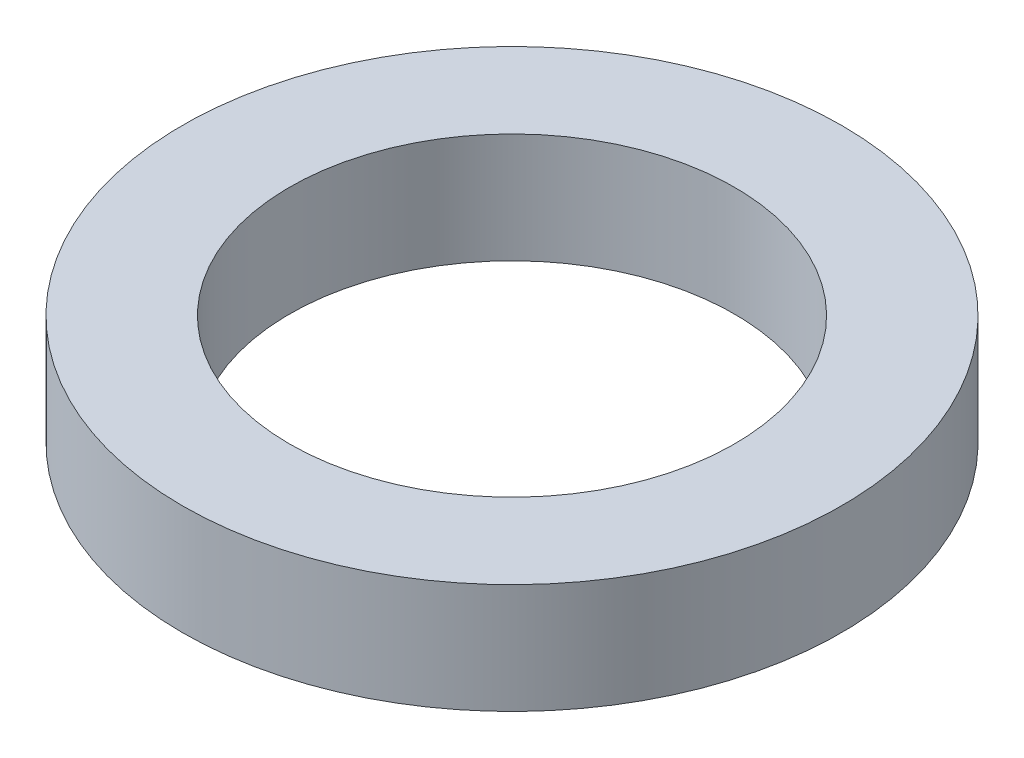
ISO-10303-21;
HEADER;
FILE_DESCRIPTION(('STEP AP214'),'2;1');
FILE_NAME('part.step','',(''),(''),'','','');
FILE_SCHEMA(('AUTOMOTIVE_DESIGN { 1 0 10303 214 1 1 1 1 }'));
ENDSEC;
DATA;
#1=APPLICATION_CONTEXT('core data for automotive mechanical design processes');
#2=APPLICATION_PROTOCOL_DEFINITION('international standard','automotive_design',2000,#1);
#3=PRODUCT_CONTEXT('',#1,'mechanical');
#4=PRODUCT('Part','Part','',(#3));
#5=PRODUCT_RELATED_PRODUCT_CATEGORY('part','',(#4));
#6=PRODUCT_DEFINITION_FORMATION('','',#4);
#7=PRODUCT_DEFINITION_CONTEXT('part definition',#1,'design');
#8=PRODUCT_DEFINITION('design','',#6,#7);
#9=PRODUCT_DEFINITION_SHAPE('','',#8);
#10=(LENGTH_UNIT() NAMED_UNIT(*) SI_UNIT(.MILLI.,.METRE.));
#11=(NAMED_UNIT(*) PLANE_ANGLE_UNIT() SI_UNIT($,.RADIAN.));
#12=(NAMED_UNIT(*) SI_UNIT($,.STERADIAN.) SOLID_ANGLE_UNIT());
#13=UNCERTAINTY_MEASURE_WITH_UNIT(LENGTH_MEASURE(1.E-05),#10,'distance_accuracy_value','');
#14=(GEOMETRIC_REPRESENTATION_CONTEXT(3) GLOBAL_UNCERTAINTY_ASSIGNED_CONTEXT((#13)) GLOBAL_UNIT_ASSIGNED_CONTEXT((#10,
#11,#12)) REPRESENTATION_CONTEXT('',''));
#15=CARTESIAN_POINT('',(0.,0.,0.));
#16=DIRECTION('',(0.,0.,1.));
#17=DIRECTION('',(1.,0.,0.));
#18=AXIS2_PLACEMENT_3D('',#15,#16,#17);
#19=CARTESIAN_POINT('',(0.,2.,0.));
#20=DIRECTION('',(0.,1.,0.));
#21=DIRECTION('',(0.,0.,1.));
#22=AXIS2_PLACEMENT_3D('',#19,#20,#21);
#23=PLANE('',#22);
#24=CARTESIAN_POINT('',(0.,2.,0.));
#25=DIRECTION('',(0.,1.,0.));
#26=DIRECTION('',(0.,0.,1.));
#27=AXIS2_PLACEMENT_3D('',#24,#25,#26);
#28=CIRCLE('',#27,6.);
#29=CARTESIAN_POINT('',(0.,2.,6.));
#30=VERTEX_POINT('',#29);
#31=EDGE_CURVE('E10',#30,#30,#28,.T.);
#32=ORIENTED_EDGE('',*,*,#31,.T.);
#33=EDGE_LOOP('',(#32));
#34=FACE_BOUND('',#33,.T.);
#35=CARTESIAN_POINT('',(0.,2.,0.));
#36=DIRECTION('',(0.,1.,0.));
#37=DIRECTION('',(0.,0.,1.));
#38=AXIS2_PLACEMENT_3D('',#35,#36,#37);
#39=CIRCLE('',#38,4.05);
#40=CARTESIAN_POINT('',(0.,2.,4.05));
#41=VERTEX_POINT('',#40);
#42=EDGE_CURVE('E56',#41,#41,#39,.T.);
#43=ORIENTED_EDGE('',*,*,#42,.F.);
#44=EDGE_LOOP('',(#43));
#45=FACE_BOUND('',#44,.T.);
#46=ADVANCED_FACE('F43',(#34,#45),#23,.T.);
#47=CARTESIAN_POINT('',(0.,0.,0.));
#48=DIRECTION('',(0.,1.,0.));
#49=DIRECTION('',(0.,0.,1.));
#50=AXIS2_PLACEMENT_3D('',#47,#48,#49);
#51=PLANE('',#50);
#52=CARTESIAN_POINT('',(0.,0.,0.));
#53=DIRECTION('',(0.,1.,0.));
#54=DIRECTION('',(0.,0.,1.));
#55=AXIS2_PLACEMENT_3D('',#52,#53,#54);
#56=CIRCLE('',#55,6.);
#57=CARTESIAN_POINT('',(0.,0.,6.));
#58=VERTEX_POINT('',#57);
#59=EDGE_CURVE('E47',#58,#58,#56,.T.);
#60=ORIENTED_EDGE('',*,*,#59,.F.);
#61=EDGE_LOOP('',(#60));
#62=FACE_BOUND('',#61,.T.);
#63=CARTESIAN_POINT('',(0.,0.,0.));
#64=DIRECTION('',(0.,1.,0.));
#65=DIRECTION('',(0.,0.,1.));
#66=AXIS2_PLACEMENT_3D('',#63,#64,#65);
#67=CIRCLE('',#66,4.05);
#68=CARTESIAN_POINT('',(0.,0.,4.05));
#69=VERTEX_POINT('',#68);
#70=EDGE_CURVE('E58',#69,#69,#67,.T.);
#71=ORIENTED_EDGE('',*,*,#70,.T.);
#72=EDGE_LOOP('',(#71));
#73=FACE_BOUND('',#72,.T.);
#74=ADVANCED_FACE('F70',(#62,#73),#51,.F.);
#75=CARTESIAN_POINT('',(0.,2.,0.));
#76=DIRECTION('',(0.,-1.,0.));
#77=DIRECTION('',(0.,0.,-1.));
#78=AXIS2_PLACEMENT_3D('',#75,#76,#77);
#79=CYLINDRICAL_SURFACE('',#78,6.);
#80=ORIENTED_EDGE('',*,*,#31,.F.);
#81=EDGE_LOOP('',(#80));
#82=FACE_BOUND('',#81,.T.);
#83=ORIENTED_EDGE('',*,*,#59,.T.);
#84=EDGE_LOOP('',(#83));
#85=FACE_BOUND('',#84,.T.);
#86=ADVANCED_FACE('F45',(#82,#85),#79,.T.);
#87=CARTESIAN_POINT('',(0.,2.,0.));
#88=DIRECTION('',(0.,-1.,0.));
#89=DIRECTION('',(0.,0.,-1.));
#90=AXIS2_PLACEMENT_3D('',#87,#88,#89);
#91=CYLINDRICAL_SURFACE('',#90,4.05);
#92=ORIENTED_EDGE('',*,*,#42,.T.);
#93=EDGE_LOOP('',(#92));
#94=FACE_BOUND('',#93,.T.);
#95=ORIENTED_EDGE('',*,*,#70,.F.);
#96=EDGE_LOOP('',(#95));
#97=FACE_BOUND('',#96,.T.);
#98=ADVANCED_FACE('F66',(#94,#97),#91,.F.);
#99=CLOSED_SHELL('',(#46,#74,#86,#98));
#100=MANIFOLD_SOLID_BREP('B2',#99);
#101=ADVANCED_BREP_SHAPE_REPRESENTATION('',(#18,#100),#14);
#102=SHAPE_DEFINITION_REPRESENTATION(#9,#101);
ENDSEC;
END-ISO-10303-21;
